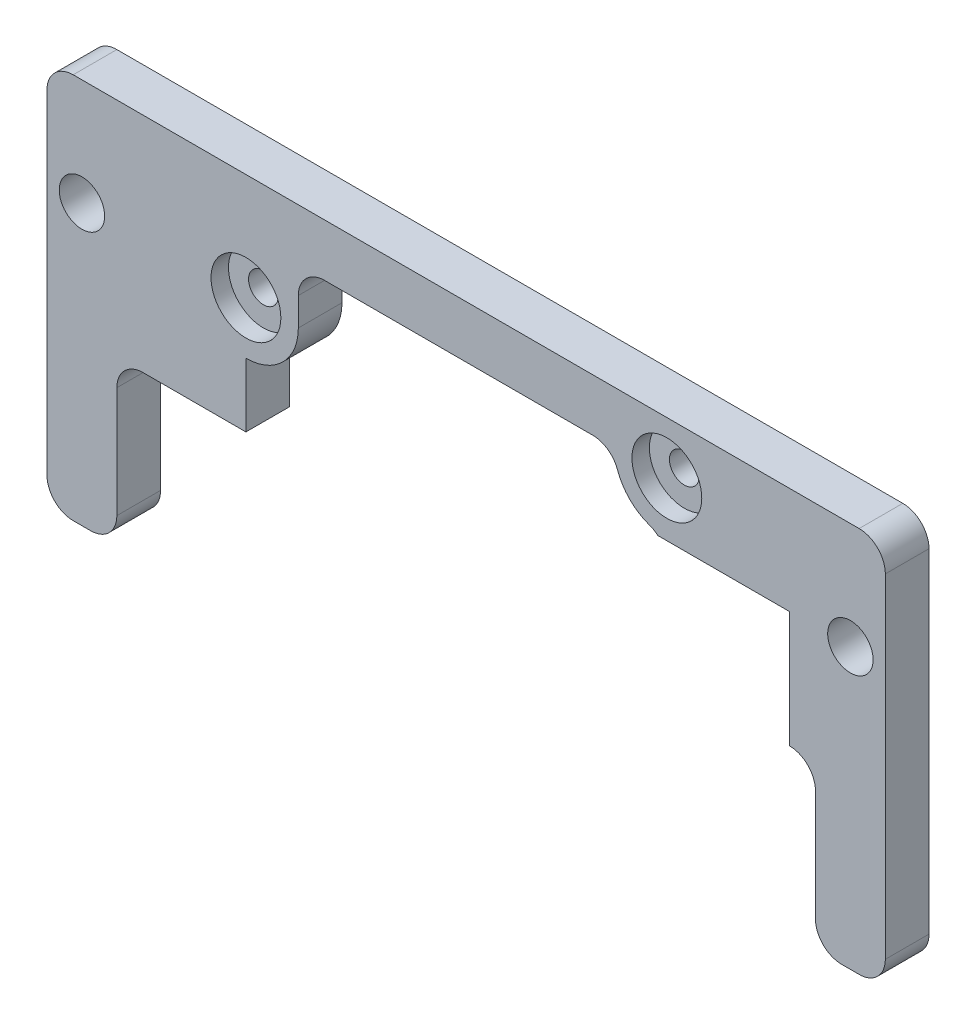
ISO-10303-21;
HEADER;
FILE_DESCRIPTION(('STEP AP214'),'2;1');
FILE_NAME('part.step','',(''),(''),'','','');
FILE_SCHEMA(('AUTOMOTIVE_DESIGN { 1 0 10303 214 1 1 1 1 }'));
ENDSEC;
DATA;
#1=APPLICATION_CONTEXT('core data for automotive mechanical design processes');
#2=APPLICATION_PROTOCOL_DEFINITION('international standard','automotive_design',2000,#1);
#3=PRODUCT_CONTEXT('',#1,'mechanical');
#4=PRODUCT('Part','Part','',(#3));
#5=PRODUCT_RELATED_PRODUCT_CATEGORY('part','',(#4));
#6=PRODUCT_DEFINITION_FORMATION('','',#4);
#7=PRODUCT_DEFINITION_CONTEXT('part definition',#1,'design');
#8=PRODUCT_DEFINITION('design','',#6,#7);
#9=PRODUCT_DEFINITION_SHAPE('','',#8);
#10=(LENGTH_UNIT() NAMED_UNIT(*) SI_UNIT(.MILLI.,.METRE.));
#11=(NAMED_UNIT(*) PLANE_ANGLE_UNIT() SI_UNIT($,.RADIAN.));
#12=(NAMED_UNIT(*) SI_UNIT($,.STERADIAN.) SOLID_ANGLE_UNIT());
#13=UNCERTAINTY_MEASURE_WITH_UNIT(LENGTH_MEASURE(1.E-05),#10,'distance_accuracy_value','');
#14=(GEOMETRIC_REPRESENTATION_CONTEXT(3) GLOBAL_UNCERTAINTY_ASSIGNED_CONTEXT((#13)) GLOBAL_UNIT_ASSIGNED_CONTEXT((#10,
#11,#12)) REPRESENTATION_CONTEXT('',''));
#15=CARTESIAN_POINT('',(0.,0.,0.));
#16=DIRECTION('',(0.,0.,1.));
#17=DIRECTION('',(1.,0.,0.));
#18=AXIS2_PLACEMENT_3D('',#15,#16,#17);
#19=CARTESIAN_POINT('',(66.9795452652619,6.22,5.));
#20=DIRECTION('',(0.,0.,-1.));
#21=DIRECTION('',(-1.,0.,0.));
#22=AXIS2_PLACEMENT_3D('',#19,#20,#21);
#23=CYLINDRICAL_SURFACE('',#22,1.7);
#24=CARTESIAN_POINT('',(66.9795452652619,6.22,0.));
#25=DIRECTION('',(0.,0.,1.));
#26=DIRECTION('',(1.,0.,0.));
#27=AXIS2_PLACEMENT_3D('',#24,#25,#26);
#28=CIRCLE('',#27,1.7);
#29=CARTESIAN_POINT('',(68.6795452652619,6.22,0.));
#30=VERTEX_POINT('',#29);
#31=EDGE_CURVE('E252',#30,#30,#28,.T.);
#32=ORIENTED_EDGE('',*,*,#31,.F.);
#33=EDGE_LOOP('',(#32));
#34=FACE_BOUND('',#33,.T.);
#35=CARTESIAN_POINT('',(66.9795452652619,6.22,3.));
#36=DIRECTION('',(0.,0.,1.));
#37=DIRECTION('',(1.,0.,0.));
#38=AXIS2_PLACEMENT_3D('',#35,#36,#37);
#39=CIRCLE('',#38,1.7);
#40=CARTESIAN_POINT('',(68.6795452652619,6.22,3.));
#41=VERTEX_POINT('',#40);
#42=EDGE_CURVE('E37',#41,#41,#39,.T.);
#43=ORIENTED_EDGE('',*,*,#42,.T.);
#44=EDGE_LOOP('',(#43));
#45=FACE_BOUND('',#44,.T.);
#46=ADVANCED_FACE('F33',(#34,#45),#23,.F.);
#47=CARTESIAN_POINT('',(18.7795452652619,0.,5.));
#48=DIRECTION('',(0.,0.,-1.));
#49=DIRECTION('',(-1.,0.,0.));
#50=AXIS2_PLACEMENT_3D('',#47,#48,#49);
#51=CYLINDRICAL_SURFACE('',#50,1.7);
#52=CARTESIAN_POINT('',(18.7795452652619,0.,0.));
#53=DIRECTION('',(0.,0.,1.));
#54=DIRECTION('',(1.,0.,0.));
#55=AXIS2_PLACEMENT_3D('',#52,#53,#54);
#56=CIRCLE('',#55,1.7);
#57=CARTESIAN_POINT('',(20.4795452652619,0.,0.));
#58=VERTEX_POINT('',#57);
#59=EDGE_CURVE('E257',#58,#58,#56,.T.);
#60=ORIENTED_EDGE('',*,*,#59,.F.);
#61=EDGE_LOOP('',(#60));
#62=FACE_BOUND('',#61,.T.);
#63=CARTESIAN_POINT('',(18.7795452652619,0.,3.));
#64=DIRECTION('',(0.,0.,1.));
#65=DIRECTION('',(1.,0.,0.));
#66=AXIS2_PLACEMENT_3D('',#63,#64,#65);
#67=CIRCLE('',#66,1.7);
#68=CARTESIAN_POINT('',(20.4795452652619,0.,3.));
#69=VERTEX_POINT('',#68);
#70=EDGE_CURVE('E250',#69,#69,#67,.T.);
#71=ORIENTED_EDGE('',*,*,#70,.T.);
#72=EDGE_LOOP('',(#71));
#73=FACE_BOUND('',#72,.T.);
#74=ADVANCED_FACE('F338',(#62,#73),#51,.F.);
#75=CARTESIAN_POINT('',(-1.,9.22,5.));
#76=DIRECTION('',(0.,0.,1.));
#77=DIRECTION('',(1.,0.,0.));
#78=AXIS2_PLACEMENT_3D('',#75,#76,#77);
#79=PLANE('',#78);
#80=DIRECTION('',(0.,-1.,0.));
#81=VECTOR('',#80,1.);
#82=CARTESIAN_POINT('',(18.7795452652619,-10.3122345298576,5.));
#83=LINE('',#82,#81);
#84=CARTESIAN_POINT('',(18.7795452652619,-6.,5.));
#85=VERTEX_POINT('',#84);
#86=CARTESIAN_POINT('',(18.7795452652619,-13.3122345298576,5.));
#87=VERTEX_POINT('',#86);
#88=EDGE_CURVE('E659',#85,#87,#83,.T.);
#89=ORIENTED_EDGE('',*,*,#88,.F.);
#90=CARTESIAN_POINT('',(18.7795452652619,0.,5.));
#91=DIRECTION('',(0.,0.,-1.));
#92=DIRECTION('',(1.,0.,0.));
#93=AXIS2_PLACEMENT_3D('',#90,#91,#92);
#94=CIRCLE('',#93,6.);
#95=CARTESIAN_POINT('',(24.7795452652619,0.,5.));
#96=VERTEX_POINT('',#95);
#97=EDGE_CURVE('E656',#96,#85,#94,.T.);
#98=ORIENTED_EDGE('',*,*,#97,.F.);
#99=DIRECTION('',(0.,-1.,0.));
#100=VECTOR('',#99,1.);
#101=CARTESIAN_POINT('',(24.7795452652619,3.21999999999998,5.));
#102=LINE('',#101,#100);
#103=CARTESIAN_POINT('',(24.7795452652619,3.21999999999998,5.));
#104=VERTEX_POINT('',#103);
#105=EDGE_CURVE('E653',#104,#96,#102,.T.);
#106=ORIENTED_EDGE('',*,*,#105,.F.);
#107=CARTESIAN_POINT('',(27.7795452652619,3.22,5.));
#108=DIRECTION('',(0.,0.,1.));
#109=DIRECTION('',(1.,0.,0.));
#110=AXIS2_PLACEMENT_3D('',#107,#108,#109);
#111=CIRCLE('',#110,3.);
#112=CARTESIAN_POINT('',(27.779545265262,6.22,5.));
#113=VERTEX_POINT('',#112);
#114=EDGE_CURVE('E650',#113,#104,#111,.T.);
#115=ORIENTED_EDGE('',*,*,#114,.F.);
#116=DIRECTION('',(-1.,0.,0.));
#117=VECTOR('',#116,1.);
#118=CARTESIAN_POINT('',(58.4942638910234,6.22,5.));
#119=LINE('',#118,#117);
#120=CARTESIAN_POINT('',(58.4942638910234,6.22,5.));
#121=VERTEX_POINT('',#120);
#122=EDGE_CURVE('E647',#121,#113,#119,.T.);
#123=ORIENTED_EDGE('',*,*,#122,.F.);
#124=CARTESIAN_POINT('',(58.4942638910234,3.22,5.));
#125=DIRECTION('',(0.,0.,1.));
#126=DIRECTION('',(1.,0.,0.));
#127=AXIS2_PLACEMENT_3D('',#124,#125,#126);
#128=CIRCLE('',#127,3.);
#129=CARTESIAN_POINT('',(61.3226910157695,4.22,5.));
#130=VERTEX_POINT('',#129);
#131=EDGE_CURVE('E644',#130,#121,#128,.T.);
#132=ORIENTED_EDGE('',*,*,#131,.F.);
#133=CARTESIAN_POINT('',(66.9795452652619,6.22,5.));
#134=DIRECTION('',(0.,0.,-1.));
#135=DIRECTION('',(-1.,0.,0.));
#136=AXIS2_PLACEMENT_3D('',#133,#134,#135);
#137=CIRCLE('',#136,6.);
#138=CARTESIAN_POINT('',(64.9795452652619,0.56314575050762,5.));
#139=VERTEX_POINT('',#138);
#140=EDGE_CURVE('E638',#139,#130,#137,.T.);
#141=ORIENTED_EDGE('',*,*,#140,.F.);
#142=CARTESIAN_POINT('',(63.9795452652619,-2.26528137423857,5.));
#143=DIRECTION('',(0.,0.,1.));
#144=DIRECTION('',(-1.,0.,0.));
#145=AXIS2_PLACEMENT_3D('',#142,#143,#144);
#146=CIRCLE('',#145,3.);
#147=CARTESIAN_POINT('',(65.9463956143042,0.,5.));
#148=VERTEX_POINT('',#147);
#149=EDGE_CURVE('E635',#148,#139,#146,.T.);
#150=ORIENTED_EDGE('',*,*,#149,.F.);
#151=DIRECTION('',(-1.,0.,0.));
#152=VECTOR('',#151,1.);
#153=CARTESIAN_POINT('',(81.,0.,5.));
#154=LINE('',#153,#152);
#155=CARTESIAN_POINT('',(81.,0.,5.));
#156=VERTEX_POINT('',#155);
#157=EDGE_CURVE('E629',#156,#148,#154,.T.);
#158=ORIENTED_EDGE('',*,*,#157,.F.);
#159=DIRECTION('',(0.,1.,0.));
#160=VECTOR('',#159,1.);
#161=CARTESIAN_POINT('',(81.,-13.3122345298576,5.));
#162=LINE('',#161,#160);
#163=CARTESIAN_POINT('',(81.,-13.3122345298576,5.));
#164=VERTEX_POINT('',#163);
#165=EDGE_CURVE('E619',#164,#156,#162,.T.);
#166=ORIENTED_EDGE('',*,*,#165,.F.);
#167=CARTESIAN_POINT('',(81.,-16.3122345298576,5.));
#168=DIRECTION('',(0.,0.,-1.));
#169=DIRECTION('',(1.,0.,0.));
#170=AXIS2_PLACEMENT_3D('',#167,#168,#169);
#171=CIRCLE('',#170,3.);
#172=CARTESIAN_POINT('',(84.,-16.3122345298576,5.));
#173=VERTEX_POINT('',#172);
#174=EDGE_CURVE('E298',#164,#173,#171,.T.);
#175=ORIENTED_EDGE('',*,*,#174,.T.);
#176=DIRECTION('',(0.,-1.,0.));
#177=VECTOR('',#176,1.);
#178=CARTESIAN_POINT('',(84.,-29.,5.));
#179=LINE('',#178,#177);
#180=CARTESIAN_POINT('',(84.,-29.,5.));
#181=VERTEX_POINT('',#180);
#182=EDGE_CURVE('E300',#173,#181,#179,.T.);
#183=ORIENTED_EDGE('',*,*,#182,.T.);
#184=CARTESIAN_POINT('',(87.,-29.,5.));
#185=DIRECTION('',(0.,0.,1.));
#186=DIRECTION('',(-1.,0.,0.));
#187=AXIS2_PLACEMENT_3D('',#184,#185,#186);
#188=CIRCLE('',#187,3.);
#189=CARTESIAN_POINT('',(87.,-32.,5.));
#190=VERTEX_POINT('',#189);
#191=EDGE_CURVE('E302',#181,#190,#188,.T.);
#192=ORIENTED_EDGE('',*,*,#191,.T.);
#193=DIRECTION('',(1.,0.,0.));
#194=VECTOR('',#193,1.);
#195=CARTESIAN_POINT('',(89.,-32.,5.));
#196=LINE('',#195,#194);
#197=CARTESIAN_POINT('',(89.,-32.,5.));
#198=VERTEX_POINT('',#197);
#199=EDGE_CURVE('E304',#190,#198,#196,.T.);
#200=ORIENTED_EDGE('',*,*,#199,.T.);
#201=CARTESIAN_POINT('',(89.,-29.,5.));
#202=DIRECTION('',(0.,0.,1.));
#203=DIRECTION('',(-1.,0.,0.));
#204=AXIS2_PLACEMENT_3D('',#201,#202,#203);
#205=CIRCLE('',#204,3.00000000000001);
#206=CARTESIAN_POINT('',(92.,-29.,5.));
#207=VERTEX_POINT('',#206);
#208=EDGE_CURVE('E165',#198,#207,#205,.T.);
#209=ORIENTED_EDGE('',*,*,#208,.T.);
#210=DIRECTION('',(0.,1.,0.));
#211=VECTOR('',#210,1.);
#212=CARTESIAN_POINT('',(92.,9.22,5.));
#213=LINE('',#212,#211);
#214=CARTESIAN_POINT('',(92.,9.22,5.));
#215=VERTEX_POINT('',#214);
#216=EDGE_CURVE('E157',#207,#215,#213,.T.);
#217=ORIENTED_EDGE('',*,*,#216,.T.);
#218=CARTESIAN_POINT('',(89.,9.22,5.));
#219=DIRECTION('',(0.,0.,1.));
#220=DIRECTION('',(-1.,0.,0.));
#221=AXIS2_PLACEMENT_3D('',#218,#219,#220);
#222=CIRCLE('',#221,3.);
#223=CARTESIAN_POINT('',(89.,12.22,5.));
#224=VERTEX_POINT('',#223);
#225=EDGE_CURVE('E163',#215,#224,#222,.T.);
#226=ORIENTED_EDGE('',*,*,#225,.T.);
#227=DIRECTION('',(-1.,0.,0.));
#228=VECTOR('',#227,1.);
#229=CARTESIAN_POINT('',(-0.99999999999998,12.22,5.));
#230=LINE('',#229,#228);
#231=CARTESIAN_POINT('',(-0.99999999999998,12.22,5.));
#232=VERTEX_POINT('',#231);
#233=EDGE_CURVE('E52',#224,#232,#230,.T.);
#234=ORIENTED_EDGE('',*,*,#233,.T.);
#235=CARTESIAN_POINT('',(-1.,9.22,5.));
#236=DIRECTION('',(0.,0.,1.));
#237=DIRECTION('',(1.,0.,0.));
#238=AXIS2_PLACEMENT_3D('',#235,#236,#237);
#239=CIRCLE('',#238,3.);
#240=CARTESIAN_POINT('',(-4.,9.21999999999998,5.));
#241=VERTEX_POINT('',#240);
#242=EDGE_CURVE('E215',#232,#241,#239,.T.);
#243=ORIENTED_EDGE('',*,*,#242,.T.);
#244=DIRECTION('',(0.,-1.,0.));
#245=VECTOR('',#244,1.);
#246=CARTESIAN_POINT('',(-4.,9.21999999999998,5.));
#247=LINE('',#246,#245);
#248=CARTESIAN_POINT('',(-4.,-29.,5.));
#249=VERTEX_POINT('',#248);
#250=EDGE_CURVE('E120',#241,#249,#247,.T.);
#251=ORIENTED_EDGE('',*,*,#250,.T.);
#252=CARTESIAN_POINT('',(-0.999999999999996,-29.,5.));
#253=DIRECTION('',(0.,0.,1.));
#254=DIRECTION('',(1.,0.,0.));
#255=AXIS2_PLACEMENT_3D('',#252,#253,#254);
#256=CIRCLE('',#255,3.);
#257=CARTESIAN_POINT('',(-0.999999999999974,-32.,5.));
#258=VERTEX_POINT('',#257);
#259=EDGE_CURVE('E285',#249,#258,#256,.T.);
#260=ORIENTED_EDGE('',*,*,#259,.T.);
#261=DIRECTION('',(1.,0.,0.));
#262=VECTOR('',#261,1.);
#263=CARTESIAN_POINT('',(-0.999999999999974,-32.,5.));
#264=LINE('',#263,#262);
#265=CARTESIAN_POINT('',(0.999999999999982,-32.,5.));
#266=VERTEX_POINT('',#265);
#267=EDGE_CURVE('E287',#258,#266,#264,.T.);
#268=ORIENTED_EDGE('',*,*,#267,.T.);
#269=CARTESIAN_POINT('',(1.,-29.,5.));
#270=DIRECTION('',(0.,0.,1.));
#271=DIRECTION('',(1.,0.,0.));
#272=AXIS2_PLACEMENT_3D('',#269,#270,#271);
#273=CIRCLE('',#272,3.);
#274=CARTESIAN_POINT('',(4.,-29.,5.));
#275=VERTEX_POINT('',#274);
#276=EDGE_CURVE('E289',#266,#275,#273,.T.);
#277=ORIENTED_EDGE('',*,*,#276,.T.);
#278=DIRECTION('',(0.,1.,0.));
#279=VECTOR('',#278,1.);
#280=CARTESIAN_POINT('',(4.,-29.,5.));
#281=LINE('',#280,#279);
#282=CARTESIAN_POINT('',(4.,-16.3122345298576,5.));
#283=VERTEX_POINT('',#282);
#284=EDGE_CURVE('E291',#275,#283,#281,.T.);
#285=ORIENTED_EDGE('',*,*,#284,.T.);
#286=CARTESIAN_POINT('',(7.,-16.3122345298576,5.));
#287=DIRECTION('',(0.,0.,-1.));
#288=DIRECTION('',(-1.,0.,0.));
#289=AXIS2_PLACEMENT_3D('',#286,#287,#288);
#290=CIRCLE('',#289,3.);
#291=CARTESIAN_POINT('',(7.00000000000002,-13.3122345298576,5.));
#292=VERTEX_POINT('',#291);
#293=EDGE_CURVE('E293',#283,#292,#290,.T.);
#294=ORIENTED_EDGE('',*,*,#293,.T.);
#295=DIRECTION('',(1.,0.,0.));
#296=VECTOR('',#295,1.);
#297=CARTESIAN_POINT('',(7.00000000000002,-13.3122345298576,5.));
#298=LINE('',#297,#296);
#299=EDGE_CURVE('E295',#292,#87,#298,.T.);
#300=ORIENTED_EDGE('',*,*,#299,.T.);
#301=EDGE_LOOP('',(#89,#98,#106,#115,#123,#132,#141,#150,#158,#166,#175,#183,#192,#200,#209,
#217,#226,#234,#243,#251,#260,#268,#277,#285,#294,#300));
#302=FACE_BOUND('',#301,.T.);
#303=CARTESIAN_POINT('',(66.9795452652619,6.22,5.));
#304=DIRECTION('',(0.,0.,1.));
#305=DIRECTION('',(1.,0.,0.));
#306=AXIS2_PLACEMENT_3D('',#303,#304,#305);
#307=CIRCLE('',#306,4.00000000000001);
#308=CARTESIAN_POINT('',(70.9795452652619,6.22,5.));
#309=VERTEX_POINT('',#308);
#310=EDGE_CURVE('E267',#309,#309,#307,.T.);
#311=ORIENTED_EDGE('',*,*,#310,.F.);
#312=EDGE_LOOP('',(#311));
#313=FACE_BOUND('',#312,.T.);
#314=CARTESIAN_POINT('',(18.7795452652619,0.,5.));
#315=DIRECTION('',(0.,0.,1.));
#316=DIRECTION('',(1.,0.,0.));
#317=AXIS2_PLACEMENT_3D('',#314,#315,#316);
#318=CIRCLE('',#317,4.);
#319=CARTESIAN_POINT('',(22.7795452652619,0.,5.));
#320=VERTEX_POINT('',#319);
#321=EDGE_CURVE('E260',#320,#320,#318,.T.);
#322=ORIENTED_EDGE('',*,*,#321,.F.);
#323=EDGE_LOOP('',(#322));
#324=FACE_BOUND('',#323,.T.);
#325=CARTESIAN_POINT('',(0.,0.,5.));
#326=DIRECTION('',(0.,0.,1.));
#327=DIRECTION('',(1.,0.,0.));
#328=AXIS2_PLACEMENT_3D('',#325,#326,#327);
#329=CIRCLE('',#328,2.6);
#330=CARTESIAN_POINT('',(2.6,0.,5.));
#331=VERTEX_POINT('',#330);
#332=EDGE_CURVE('E187',#331,#331,#329,.T.);
#333=ORIENTED_EDGE('',*,*,#332,.F.);
#334=EDGE_LOOP('',(#333));
#335=FACE_BOUND('',#334,.T.);
#336=CARTESIAN_POINT('',(88.,0.,5.));
#337=DIRECTION('',(0.,0.,1.));
#338=DIRECTION('',(1.,0.,0.));
#339=AXIS2_PLACEMENT_3D('',#336,#337,#338);
#340=CIRCLE('',#339,2.6);
#341=CARTESIAN_POINT('',(90.6,0.,5.));
#342=VERTEX_POINT('',#341);
#343=EDGE_CURVE('E273',#342,#342,#340,.T.);
#344=ORIENTED_EDGE('',*,*,#343,.F.);
#345=EDGE_LOOP('',(#344));
#346=FACE_BOUND('',#345,.T.);
#347=ADVANCED_FACE('F160',(#302,#313,#324,#335,#346),#79,.T.);
#348=CARTESIAN_POINT('',(-1.,9.22,0.));
#349=DIRECTION('',(0.,0.,1.));
#350=DIRECTION('',(1.,0.,0.));
#351=AXIS2_PLACEMENT_3D('',#348,#349,#350);
#352=PLANE('',#351);
#353=ORIENTED_EDGE('',*,*,#59,.T.);
#354=EDGE_LOOP('',(#353));
#355=FACE_BOUND('',#354,.T.);
#356=CARTESIAN_POINT('',(0.,0.,0.));
#357=DIRECTION('',(0.,0.,1.));
#358=DIRECTION('',(1.,0.,0.));
#359=AXIS2_PLACEMENT_3D('',#356,#357,#358);
#360=CIRCLE('',#359,2.6);
#361=CARTESIAN_POINT('',(2.6,0.,0.));
#362=VERTEX_POINT('',#361);
#363=EDGE_CURVE('E276',#362,#362,#360,.T.);
#364=ORIENTED_EDGE('',*,*,#363,.T.);
#365=EDGE_LOOP('',(#364));
#366=FACE_BOUND('',#365,.T.);
#367=CARTESIAN_POINT('',(18.7795452652619,0.,0.));
#368=DIRECTION('',(0.,0.,-1.));
#369=DIRECTION('',(1.,0.,0.));
#370=AXIS2_PLACEMENT_3D('',#367,#368,#369);
#371=CIRCLE('',#370,6.);
#372=CARTESIAN_POINT('',(24.7795452652619,0.,0.));
#373=VERTEX_POINT('',#372);
#374=CARTESIAN_POINT('',(18.7795452652619,-6.,0.));
#375=VERTEX_POINT('',#374);
#376=EDGE_CURVE('E711',#373,#375,#371,.T.);
#377=ORIENTED_EDGE('',*,*,#376,.T.);
#378=DIRECTION('',(0.,-1.,0.));
#379=VECTOR('',#378,1.);
#380=CARTESIAN_POINT('',(18.7795452652619,-6.,0.));
#381=LINE('',#380,#379);
#382=CARTESIAN_POINT('',(18.7795452652619,-13.3122345298576,0.));
#383=VERTEX_POINT('',#382);
#384=EDGE_CURVE('E690',#375,#383,#381,.T.);
#385=ORIENTED_EDGE('',*,*,#384,.T.);
#386=DIRECTION('',(1.,0.,0.));
#387=VECTOR('',#386,1.);
#388=CARTESIAN_POINT('',(7.00000000000002,-13.3122345298576,0.));
#389=LINE('',#388,#387);
#390=CARTESIAN_POINT('',(7.00000000000002,-13.3122345298576,0.));
#391=VERTEX_POINT('',#390);
#392=EDGE_CURVE('E199',#391,#383,#389,.T.);
#393=ORIENTED_EDGE('',*,*,#392,.F.);
#394=CARTESIAN_POINT('',(7.,-16.3122345298576,0.));
#395=DIRECTION('',(0.,0.,-1.));
#396=DIRECTION('',(-1.,0.,0.));
#397=AXIS2_PLACEMENT_3D('',#394,#395,#396);
#398=CIRCLE('',#397,3.);
#399=CARTESIAN_POINT('',(4.,-16.3122345298576,0.));
#400=VERTEX_POINT('',#399);
#401=EDGE_CURVE('E197',#400,#391,#398,.T.);
#402=ORIENTED_EDGE('',*,*,#401,.F.);
#403=DIRECTION('',(0.,1.,0.));
#404=VECTOR('',#403,1.);
#405=CARTESIAN_POINT('',(4.,-29.,0.));
#406=LINE('',#405,#404);
#407=CARTESIAN_POINT('',(4.,-29.,0.));
#408=VERTEX_POINT('',#407);
#409=EDGE_CURVE('E195',#408,#400,#406,.T.);
#410=ORIENTED_EDGE('',*,*,#409,.F.);
#411=CARTESIAN_POINT('',(1.,-29.,0.));
#412=DIRECTION('',(0.,0.,1.));
#413=DIRECTION('',(1.,0.,0.));
#414=AXIS2_PLACEMENT_3D('',#411,#412,#413);
#415=CIRCLE('',#414,3.);
#416=CARTESIAN_POINT('',(0.999999999999982,-32.,0.));
#417=VERTEX_POINT('',#416);
#418=EDGE_CURVE('E193',#417,#408,#415,.T.);
#419=ORIENTED_EDGE('',*,*,#418,.F.);
#420=DIRECTION('',(1.,0.,0.));
#421=VECTOR('',#420,1.);
#422=CARTESIAN_POINT('',(-0.999999999999974,-32.,0.));
#423=LINE('',#422,#421);
#424=CARTESIAN_POINT('',(-0.999999999999974,-32.,0.));
#425=VERTEX_POINT('',#424);
#426=EDGE_CURVE('E191',#425,#417,#423,.T.);
#427=ORIENTED_EDGE('',*,*,#426,.F.);
#428=CARTESIAN_POINT('',(-0.999999999999996,-29.,0.));
#429=DIRECTION('',(0.,0.,1.));
#430=DIRECTION('',(1.,0.,0.));
#431=AXIS2_PLACEMENT_3D('',#428,#429,#430);
#432=CIRCLE('',#431,3.);
#433=CARTESIAN_POINT('',(-4.,-29.,0.));
#434=VERTEX_POINT('',#433);
#435=EDGE_CURVE('E189',#434,#425,#432,.T.);
#436=ORIENTED_EDGE('',*,*,#435,.F.);
#437=DIRECTION('',(0.,-1.,0.));
#438=VECTOR('',#437,1.);
#439=CARTESIAN_POINT('',(-4.,9.21999999999998,0.));
#440=LINE('',#439,#438);
#441=CARTESIAN_POINT('',(-4.,9.21999999999998,0.));
#442=VERTEX_POINT('',#441);
#443=EDGE_CURVE('E186',#442,#434,#440,.T.);
#444=ORIENTED_EDGE('',*,*,#443,.F.);
#445=CARTESIAN_POINT('',(-1.,9.22,0.));
#446=DIRECTION('',(0.,0.,1.));
#447=DIRECTION('',(1.,0.,0.));
#448=AXIS2_PLACEMENT_3D('',#445,#446,#447);
#449=CIRCLE('',#448,3.);
#450=CARTESIAN_POINT('',(-0.99999999999998,12.22,0.));
#451=VERTEX_POINT('',#450);
#452=EDGE_CURVE('E183',#451,#442,#449,.T.);
#453=ORIENTED_EDGE('',*,*,#452,.F.);
#454=DIRECTION('',(-1.,0.,0.));
#455=VECTOR('',#454,1.);
#456=CARTESIAN_POINT('',(-0.99999999999998,12.22,0.));
#457=LINE('',#456,#455);
#458=CARTESIAN_POINT('',(89.,12.22,0.));
#459=VERTEX_POINT('',#458);
#460=EDGE_CURVE('E112',#459,#451,#457,.T.);
#461=ORIENTED_EDGE('',*,*,#460,.F.);
#462=CARTESIAN_POINT('',(89.,9.22,0.));
#463=DIRECTION('',(0.,0.,1.));
#464=DIRECTION('',(-1.,0.,0.));
#465=AXIS2_PLACEMENT_3D('',#462,#463,#464);
#466=CIRCLE('',#465,3.);
#467=CARTESIAN_POINT('',(92.,9.22,0.));
#468=VERTEX_POINT('',#467);
#469=EDGE_CURVE('E106',#468,#459,#466,.T.);
#470=ORIENTED_EDGE('',*,*,#469,.F.);
#471=DIRECTION('',(0.,1.,0.));
#472=VECTOR('',#471,1.);
#473=CARTESIAN_POINT('',(92.,9.22,0.));
#474=LINE('',#473,#472);
#475=CARTESIAN_POINT('',(92.,-29.,0.));
#476=VERTEX_POINT('',#475);
#477=EDGE_CURVE('E173',#476,#468,#474,.T.);
#478=ORIENTED_EDGE('',*,*,#477,.F.);
#479=CARTESIAN_POINT('',(89.,-29.,0.));
#480=DIRECTION('',(0.,0.,1.));
#481=DIRECTION('',(-1.,0.,0.));
#482=AXIS2_PLACEMENT_3D('',#479,#480,#481);
#483=CIRCLE('',#482,3.00000000000001);
#484=CARTESIAN_POINT('',(89.,-32.,0.));
#485=VERTEX_POINT('',#484);
#486=EDGE_CURVE('E210',#485,#476,#483,.T.);
#487=ORIENTED_EDGE('',*,*,#486,.F.);
#488=DIRECTION('',(1.,0.,0.));
#489=VECTOR('',#488,1.);
#490=CARTESIAN_POINT('',(89.,-32.,0.));
#491=LINE('',#490,#489);
#492=CARTESIAN_POINT('',(87.,-32.,0.));
#493=VERTEX_POINT('',#492);
#494=EDGE_CURVE('E208',#493,#485,#491,.T.);
#495=ORIENTED_EDGE('',*,*,#494,.F.);
#496=CARTESIAN_POINT('',(87.,-29.,0.));
#497=DIRECTION('',(0.,0.,1.));
#498=DIRECTION('',(-1.,0.,0.));
#499=AXIS2_PLACEMENT_3D('',#496,#497,#498);
#500=CIRCLE('',#499,3.);
#501=CARTESIAN_POINT('',(84.,-29.,0.));
#502=VERTEX_POINT('',#501);
#503=EDGE_CURVE('E206',#502,#493,#500,.T.);
#504=ORIENTED_EDGE('',*,*,#503,.F.);
#505=DIRECTION('',(0.,-1.,0.));
#506=VECTOR('',#505,1.);
#507=CARTESIAN_POINT('',(84.,-29.,0.));
#508=LINE('',#507,#506);
#509=CARTESIAN_POINT('',(84.,-16.3122345298576,0.));
#510=VERTEX_POINT('',#509);
#511=EDGE_CURVE('E204',#510,#502,#508,.T.);
#512=ORIENTED_EDGE('',*,*,#511,.F.);
#513=CARTESIAN_POINT('',(81.,-16.3122345298576,0.));
#514=DIRECTION('',(0.,0.,-1.));
#515=DIRECTION('',(1.,0.,0.));
#516=AXIS2_PLACEMENT_3D('',#513,#514,#515);
#517=CIRCLE('',#516,3.);
#518=CARTESIAN_POINT('',(81.,-13.3122345298576,0.));
#519=VERTEX_POINT('',#518);
#520=EDGE_CURVE('E202',#519,#510,#517,.T.);
#521=ORIENTED_EDGE('',*,*,#520,.F.);
#522=DIRECTION('',(0.,1.,0.));
#523=VECTOR('',#522,1.);
#524=CARTESIAN_POINT('',(81.,-13.3122345298576,0.));
#525=LINE('',#524,#523);
#526=CARTESIAN_POINT('',(81.,0.,0.));
#527=VERTEX_POINT('',#526);
#528=EDGE_CURVE('E662',#519,#527,#525,.T.);
#529=ORIENTED_EDGE('',*,*,#528,.T.);
#530=DIRECTION('',(-1.,0.,0.));
#531=VECTOR('',#530,1.);
#532=CARTESIAN_POINT('',(81.,0.,0.));
#533=LINE('',#532,#531);
#534=CARTESIAN_POINT('',(65.9463956143042,0.,0.));
#535=VERTEX_POINT('',#534);
#536=EDGE_CURVE('E734',#527,#535,#533,.T.);
#537=ORIENTED_EDGE('',*,*,#536,.T.);
#538=CARTESIAN_POINT('',(63.9795452652619,-2.26528137423857,0.));
#539=DIRECTION('',(0.,0.,1.));
#540=DIRECTION('',(-1.,0.,0.));
#541=AXIS2_PLACEMENT_3D('',#538,#539,#540);
#542=CIRCLE('',#541,3.);
#543=CARTESIAN_POINT('',(64.9795452652619,0.56314575050762,0.));
#544=VERTEX_POINT('',#543);
#545=EDGE_CURVE('E731',#535,#544,#542,.T.);
#546=ORIENTED_EDGE('',*,*,#545,.T.);
#547=CARTESIAN_POINT('',(66.9795452652619,6.22,0.));
#548=DIRECTION('',(0.,0.,-1.));
#549=DIRECTION('',(-1.,0.,0.));
#550=AXIS2_PLACEMENT_3D('',#547,#548,#549);
#551=CIRCLE('',#550,6.);
#552=CARTESIAN_POINT('',(61.3226910157695,4.22,0.));
#553=VERTEX_POINT('',#552);
#554=EDGE_CURVE('E728',#544,#553,#551,.T.);
#555=ORIENTED_EDGE('',*,*,#554,.T.);
#556=CARTESIAN_POINT('',(58.4942638910234,3.22,0.));
#557=DIRECTION('',(0.,0.,1.));
#558=DIRECTION('',(1.,0.,0.));
#559=AXIS2_PLACEMENT_3D('',#556,#557,#558);
#560=CIRCLE('',#559,3.);
#561=CARTESIAN_POINT('',(58.4942638910234,6.22,0.));
#562=VERTEX_POINT('',#561);
#563=EDGE_CURVE('E725',#553,#562,#560,.T.);
#564=ORIENTED_EDGE('',*,*,#563,.T.);
#565=DIRECTION('',(-1.,0.,0.));
#566=VECTOR('',#565,1.);
#567=CARTESIAN_POINT('',(58.4942638910234,6.22,0.));
#568=LINE('',#567,#566);
#569=CARTESIAN_POINT('',(27.779545265262,6.22,0.));
#570=VERTEX_POINT('',#569);
#571=EDGE_CURVE('E722',#562,#570,#568,.T.);
#572=ORIENTED_EDGE('',*,*,#571,.T.);
#573=CARTESIAN_POINT('',(27.7795452652619,3.22,0.));
#574=DIRECTION('',(0.,0.,1.));
#575=DIRECTION('',(1.,0.,0.));
#576=AXIS2_PLACEMENT_3D('',#573,#574,#575);
#577=CIRCLE('',#576,3.);
#578=CARTESIAN_POINT('',(24.7795452652619,3.21999999999998,0.));
#579=VERTEX_POINT('',#578);
#580=EDGE_CURVE('E719',#570,#579,#577,.T.);
#581=ORIENTED_EDGE('',*,*,#580,.T.);
#582=DIRECTION('',(0.,-1.,0.));
#583=VECTOR('',#582,1.);
#584=CARTESIAN_POINT('',(24.7795452652619,3.21999999999998,0.));
#585=LINE('',#584,#583);
#586=EDGE_CURVE('E714',#579,#373,#585,.T.);
#587=ORIENTED_EDGE('',*,*,#586,.T.);
#588=EDGE_LOOP('',(#377,#385,#393,#402,#410,#419,#427,#436,#444,#453,#461,#470,#478,#487,#495,
#504,#512,#521,#529,#537,#546,#555,#564,#572,#581,#587));
#589=FACE_BOUND('',#588,.T.);
#590=CARTESIAN_POINT('',(88.,0.,0.));
#591=DIRECTION('',(0.,0.,1.));
#592=DIRECTION('',(1.,0.,0.));
#593=AXIS2_PLACEMENT_3D('',#590,#591,#592);
#594=CIRCLE('',#593,2.6);
#595=CARTESIAN_POINT('',(90.6,0.,0.));
#596=VERTEX_POINT('',#595);
#597=EDGE_CURVE('E272',#596,#596,#594,.T.);
#598=ORIENTED_EDGE('',*,*,#597,.T.);
#599=EDGE_LOOP('',(#598));
#600=FACE_BOUND('',#599,.T.);
#601=ORIENTED_EDGE('',*,*,#31,.T.);
#602=EDGE_LOOP('',(#601));
#603=FACE_BOUND('',#602,.T.);
#604=ADVANCED_FACE('F317',(#355,#366,#589,#600,#603),#352,.F.);
#605=CARTESIAN_POINT('',(-1.,9.22,5.));
#606=DIRECTION('',(0.,0.,-1.));
#607=DIRECTION('',(-1.,0.,0.));
#608=AXIS2_PLACEMENT_3D('',#605,#606,#607);
#609=CYLINDRICAL_SURFACE('',#608,3.);
#610=ORIENTED_EDGE('',*,*,#452,.T.);
#611=DIRECTION('',(0.,0.,-1.));
#612=VECTOR('',#611,1.);
#613=CARTESIAN_POINT('',(-4.,9.21999999999998,5.));
#614=LINE('',#613,#612);
#615=EDGE_CURVE('E11',#241,#442,#614,.T.);
#616=ORIENTED_EDGE('',*,*,#615,.F.);
#617=ORIENTED_EDGE('',*,*,#242,.F.);
#618=DIRECTION('',(0.,0.,-1.));
#619=VECTOR('',#618,1.);
#620=CARTESIAN_POINT('',(-0.99999999999998,12.22,5.));
#621=LINE('',#620,#619);
#622=EDGE_CURVE('E179',#232,#451,#621,.T.);
#623=ORIENTED_EDGE('',*,*,#622,.T.);
#624=EDGE_LOOP('',(#610,#616,#617,#623));
#625=FACE_BOUND('',#624,.T.);
#626=ADVANCED_FACE('F35',(#625),#609,.T.);
#627=CARTESIAN_POINT('',(-4.,9.21999999999998,5.));
#628=DIRECTION('',(1.,0.,0.));
#629=DIRECTION('',(0.,1.,0.));
#630=AXIS2_PLACEMENT_3D('',#627,#628,#629);
#631=PLANE('',#630);
#632=ORIENTED_EDGE('',*,*,#443,.T.);
#633=DIRECTION('',(0.,0.,-1.));
#634=VECTOR('',#633,1.);
#635=CARTESIAN_POINT('',(-4.,-29.,5.));
#636=LINE('',#635,#634);
#637=EDGE_CURVE('E43',#249,#434,#636,.T.);
#638=ORIENTED_EDGE('',*,*,#637,.F.);
#639=ORIENTED_EDGE('',*,*,#250,.F.);
#640=ORIENTED_EDGE('',*,*,#615,.T.);
#641=EDGE_LOOP('',(#632,#638,#639,#640));
#642=FACE_BOUND('',#641,.T.);
#643=ADVANCED_FACE('F361',(#642),#631,.F.);
#644=CARTESIAN_POINT('',(-0.999999999999996,-29.,5.));
#645=DIRECTION('',(0.,0.,-1.));
#646=DIRECTION('',(-1.,0.,0.));
#647=AXIS2_PLACEMENT_3D('',#644,#645,#646);
#648=CYLINDRICAL_SURFACE('',#647,3.);
#649=ORIENTED_EDGE('',*,*,#435,.T.);
#650=DIRECTION('',(0.,0.,-1.));
#651=VECTOR('',#650,1.);
#652=CARTESIAN_POINT('',(-0.999999999999974,-32.,5.));
#653=LINE('',#652,#651);
#654=EDGE_CURVE('E246',#258,#425,#653,.T.);
#655=ORIENTED_EDGE('',*,*,#654,.F.);
#656=ORIENTED_EDGE('',*,*,#259,.F.);
#657=ORIENTED_EDGE('',*,*,#637,.T.);
#658=EDGE_LOOP('',(#649,#655,#656,#657));
#659=FACE_BOUND('',#658,.T.);
#660=ADVANCED_FACE('F369',(#659),#648,.T.);
#661=CARTESIAN_POINT('',(-0.999999999999974,-32.,5.));
#662=DIRECTION('',(0.,1.,0.));
#663=DIRECTION('',(0.,0.,1.));
#664=AXIS2_PLACEMENT_3D('',#661,#662,#663);
#665=PLANE('',#664);
#666=ORIENTED_EDGE('',*,*,#426,.T.);
#667=DIRECTION('',(0.,0.,-1.));
#668=VECTOR('',#667,1.);
#669=CARTESIAN_POINT('',(0.999999999999982,-32.,5.));
#670=LINE('',#669,#668);
#671=EDGE_CURVE('E243',#266,#417,#670,.T.);
#672=ORIENTED_EDGE('',*,*,#671,.F.);
#673=ORIENTED_EDGE('',*,*,#267,.F.);
#674=ORIENTED_EDGE('',*,*,#654,.T.);
#675=EDGE_LOOP('',(#666,#672,#673,#674));
#676=FACE_BOUND('',#675,.T.);
#677=ADVANCED_FACE('F373',(#676),#665,.F.);
#678=CARTESIAN_POINT('',(1.,-29.,5.));
#679=DIRECTION('',(0.,0.,-1.));
#680=DIRECTION('',(-1.,0.,0.));
#681=AXIS2_PLACEMENT_3D('',#678,#679,#680);
#682=CYLINDRICAL_SURFACE('',#681,3.);
#683=ORIENTED_EDGE('',*,*,#418,.T.);
#684=DIRECTION('',(0.,0.,-1.));
#685=VECTOR('',#684,1.);
#686=CARTESIAN_POINT('',(4.,-29.,5.));
#687=LINE('',#686,#685);
#688=EDGE_CURVE('E240',#275,#408,#687,.T.);
#689=ORIENTED_EDGE('',*,*,#688,.F.);
#690=ORIENTED_EDGE('',*,*,#276,.F.);
#691=ORIENTED_EDGE('',*,*,#671,.T.);
#692=EDGE_LOOP('',(#683,#689,#690,#691));
#693=FACE_BOUND('',#692,.T.);
#694=ADVANCED_FACE('F379',(#693),#682,.T.);
#695=CARTESIAN_POINT('',(4.,-29.,5.));
#696=DIRECTION('',(-1.,0.,0.));
#697=DIRECTION('',(0.,0.,1.));
#698=AXIS2_PLACEMENT_3D('',#695,#696,#697);
#699=PLANE('',#698);
#700=ORIENTED_EDGE('',*,*,#409,.T.);
#701=DIRECTION('',(0.,0.,-1.));
#702=VECTOR('',#701,1.);
#703=CARTESIAN_POINT('',(4.,-16.3122345298576,5.));
#704=LINE('',#703,#702);
#705=EDGE_CURVE('E237',#283,#400,#704,.T.);
#706=ORIENTED_EDGE('',*,*,#705,.F.);
#707=ORIENTED_EDGE('',*,*,#284,.F.);
#708=ORIENTED_EDGE('',*,*,#688,.T.);
#709=EDGE_LOOP('',(#700,#706,#707,#708));
#710=FACE_BOUND('',#709,.T.);
#711=ADVANCED_FACE('F383',(#710),#699,.F.);
#712=CARTESIAN_POINT('',(7.,-16.3122345298576,5.));
#713=DIRECTION('',(0.,0.,-1.));
#714=DIRECTION('',(-1.,0.,0.));
#715=AXIS2_PLACEMENT_3D('',#712,#713,#714);
#716=CYLINDRICAL_SURFACE('',#715,3.);
#717=ORIENTED_EDGE('',*,*,#401,.T.);
#718=DIRECTION('',(0.,0.,-1.));
#719=VECTOR('',#718,1.);
#720=CARTESIAN_POINT('',(7.00000000000002,-13.3122345298576,5.));
#721=LINE('',#720,#719);
#722=EDGE_CURVE('E234',#292,#391,#721,.T.);
#723=ORIENTED_EDGE('',*,*,#722,.F.);
#724=ORIENTED_EDGE('',*,*,#293,.F.);
#725=ORIENTED_EDGE('',*,*,#705,.T.);
#726=EDGE_LOOP('',(#717,#723,#724,#725));
#727=FACE_BOUND('',#726,.T.);
#728=ADVANCED_FACE('F387',(#727),#716,.F.);
#729=CARTESIAN_POINT('',(7.00000000000002,-13.3122345298576,5.));
#730=DIRECTION('',(0.,1.,0.));
#731=DIRECTION('',(-1.,0.,0.));
#732=AXIS2_PLACEMENT_3D('',#729,#730,#731);
#733=PLANE('',#732);
#734=ORIENTED_EDGE('',*,*,#392,.T.);
#735=DIRECTION('',(0.,0.,1.));
#736=VECTOR('',#735,1.);
#737=CARTESIAN_POINT('',(18.7795452652619,-13.3122345298576,0.));
#738=LINE('',#737,#736);
#739=EDGE_CURVE('E663',#383,#87,#738,.T.);
#740=ORIENTED_EDGE('',*,*,#739,.T.);
#741=ORIENTED_EDGE('',*,*,#299,.F.);
#742=ORIENTED_EDGE('',*,*,#722,.T.);
#743=EDGE_LOOP('',(#734,#740,#741,#742));
#744=FACE_BOUND('',#743,.T.);
#745=ADVANCED_FACE('F391',(#744),#733,.F.);
#746=CARTESIAN_POINT('',(81.,-16.3122345298576,5.));
#747=DIRECTION('',(0.,0.,-1.));
#748=DIRECTION('',(-1.,0.,0.));
#749=AXIS2_PLACEMENT_3D('',#746,#747,#748);
#750=CYLINDRICAL_SURFACE('',#749,3.);
#751=ORIENTED_EDGE('',*,*,#520,.T.);
#752=DIRECTION('',(0.,0.,-1.));
#753=VECTOR('',#752,1.);
#754=CARTESIAN_POINT('',(84.,-16.3122345298576,5.));
#755=LINE('',#754,#753);
#756=EDGE_CURVE('E228',#173,#510,#755,.T.);
#757=ORIENTED_EDGE('',*,*,#756,.F.);
#758=ORIENTED_EDGE('',*,*,#174,.F.);
#759=DIRECTION('',(0.,0.,-1.));
#760=VECTOR('',#759,1.);
#761=CARTESIAN_POINT('',(81.,-13.3122345298576,5.));
#762=LINE('',#761,#760);
#763=EDGE_CURVE('E231',#164,#519,#762,.T.);
#764=ORIENTED_EDGE('',*,*,#763,.T.);
#765=EDGE_LOOP('',(#751,#757,#758,#764));
#766=FACE_BOUND('',#765,.T.);
#767=ADVANCED_FACE('F395',(#766),#750,.F.);
#768=CARTESIAN_POINT('',(84.,-29.,5.));
#769=DIRECTION('',(1.,0.,0.));
#770=DIRECTION('',(0.,0.,-1.));
#771=AXIS2_PLACEMENT_3D('',#768,#769,#770);
#772=PLANE('',#771);
#773=ORIENTED_EDGE('',*,*,#511,.T.);
#774=DIRECTION('',(0.,0.,-1.));
#775=VECTOR('',#774,1.);
#776=CARTESIAN_POINT('',(84.,-29.,5.));
#777=LINE('',#776,#775);
#778=EDGE_CURVE('E225',#181,#502,#777,.T.);
#779=ORIENTED_EDGE('',*,*,#778,.F.);
#780=ORIENTED_EDGE('',*,*,#182,.F.);
#781=ORIENTED_EDGE('',*,*,#756,.T.);
#782=EDGE_LOOP('',(#773,#779,#780,#781));
#783=FACE_BOUND('',#782,.T.);
#784=ADVANCED_FACE('F399',(#783),#772,.F.);
#785=CARTESIAN_POINT('',(87.,-29.,5.));
#786=DIRECTION('',(0.,0.,-1.));
#787=DIRECTION('',(-1.,0.,0.));
#788=AXIS2_PLACEMENT_3D('',#785,#786,#787);
#789=CYLINDRICAL_SURFACE('',#788,3.);
#790=ORIENTED_EDGE('',*,*,#503,.T.);
#791=DIRECTION('',(0.,0.,-1.));
#792=VECTOR('',#791,1.);
#793=CARTESIAN_POINT('',(87.,-32.,5.));
#794=LINE('',#793,#792);
#795=EDGE_CURVE('E222',#190,#493,#794,.T.);
#796=ORIENTED_EDGE('',*,*,#795,.F.);
#797=ORIENTED_EDGE('',*,*,#191,.F.);
#798=ORIENTED_EDGE('',*,*,#778,.T.);
#799=EDGE_LOOP('',(#790,#796,#797,#798));
#800=FACE_BOUND('',#799,.T.);
#801=ADVANCED_FACE('F403',(#800),#789,.T.);
#802=CARTESIAN_POINT('',(89.,-32.,5.));
#803=DIRECTION('',(0.,1.,0.));
#804=DIRECTION('',(0.,0.,1.));
#805=AXIS2_PLACEMENT_3D('',#802,#803,#804);
#806=PLANE('',#805);
#807=ORIENTED_EDGE('',*,*,#494,.T.);
#808=DIRECTION('',(0.,0.,-1.));
#809=VECTOR('',#808,1.);
#810=CARTESIAN_POINT('',(89.,-32.,5.));
#811=LINE('',#810,#809);
#812=EDGE_CURVE('E219',#198,#485,#811,.T.);
#813=ORIENTED_EDGE('',*,*,#812,.F.);
#814=ORIENTED_EDGE('',*,*,#199,.F.);
#815=ORIENTED_EDGE('',*,*,#795,.T.);
#816=EDGE_LOOP('',(#807,#813,#814,#815));
#817=FACE_BOUND('',#816,.T.);
#818=ADVANCED_FACE('F310',(#817),#806,.F.);
#819=CARTESIAN_POINT('',(89.,-29.,5.));
#820=DIRECTION('',(0.,0.,-1.));
#821=DIRECTION('',(-1.,0.,0.));
#822=AXIS2_PLACEMENT_3D('',#819,#820,#821);
#823=CYLINDRICAL_SURFACE('',#822,3.00000000000001);
#824=ORIENTED_EDGE('',*,*,#486,.T.);
#825=DIRECTION('',(0.,0.,-1.));
#826=VECTOR('',#825,1.);
#827=CARTESIAN_POINT('',(92.,-29.,5.));
#828=LINE('',#827,#826);
#829=EDGE_CURVE('E174',#207,#476,#828,.T.);
#830=ORIENTED_EDGE('',*,*,#829,.F.);
#831=ORIENTED_EDGE('',*,*,#208,.F.);
#832=ORIENTED_EDGE('',*,*,#812,.T.);
#833=EDGE_LOOP('',(#824,#830,#831,#832));
#834=FACE_BOUND('',#833,.T.);
#835=ADVANCED_FACE('F314',(#834),#823,.T.);
#836=CARTESIAN_POINT('',(92.,9.22,5.));
#837=DIRECTION('',(-1.,0.,0.));
#838=DIRECTION('',(0.,-1.,0.));
#839=AXIS2_PLACEMENT_3D('',#836,#837,#838);
#840=PLANE('',#839);
#841=ORIENTED_EDGE('',*,*,#477,.T.);
#842=DIRECTION('',(0.,0.,-1.));
#843=VECTOR('',#842,1.);
#844=CARTESIAN_POINT('',(92.,9.22,5.));
#845=LINE('',#844,#843);
#846=EDGE_CURVE('E170',#215,#468,#845,.T.);
#847=ORIENTED_EDGE('',*,*,#846,.F.);
#848=ORIENTED_EDGE('',*,*,#216,.F.);
#849=ORIENTED_EDGE('',*,*,#829,.T.);
#850=EDGE_LOOP('',(#841,#847,#848,#849));
#851=FACE_BOUND('',#850,.T.);
#852=ADVANCED_FACE('F171',(#851),#840,.F.);
#853=CARTESIAN_POINT('',(89.,9.22,5.));
#854=DIRECTION('',(0.,0.,-1.));
#855=DIRECTION('',(-1.,0.,0.));
#856=AXIS2_PLACEMENT_3D('',#853,#854,#855);
#857=CYLINDRICAL_SURFACE('',#856,3.);
#858=ORIENTED_EDGE('',*,*,#469,.T.);
#859=DIRECTION('',(0.,0.,-1.));
#860=VECTOR('',#859,1.);
#861=CARTESIAN_POINT('',(89.,12.22,5.));
#862=LINE('',#861,#860);
#863=EDGE_CURVE('E175',#224,#459,#862,.T.);
#864=ORIENTED_EDGE('',*,*,#863,.F.);
#865=ORIENTED_EDGE('',*,*,#225,.F.);
#866=ORIENTED_EDGE('',*,*,#846,.T.);
#867=EDGE_LOOP('',(#858,#864,#865,#866));
#868=FACE_BOUND('',#867,.T.);
#869=ADVANCED_FACE('F177',(#868),#857,.T.);
#870=CARTESIAN_POINT('',(-0.99999999999998,12.22,5.));
#871=DIRECTION('',(0.,-1.,0.));
#872=DIRECTION('',(1.,0.,0.));
#873=AXIS2_PLACEMENT_3D('',#870,#871,#872);
#874=PLANE('',#873);
#875=ORIENTED_EDGE('',*,*,#460,.T.);
#876=ORIENTED_EDGE('',*,*,#622,.F.);
#877=ORIENTED_EDGE('',*,*,#233,.F.);
#878=ORIENTED_EDGE('',*,*,#863,.T.);
#879=EDGE_LOOP('',(#875,#876,#877,#878));
#880=FACE_BOUND('',#879,.T.);
#881=ADVANCED_FACE('F324',(#880),#874,.F.);
#882=CARTESIAN_POINT('',(0.,0.,5.));
#883=DIRECTION('',(0.,0.,-1.));
#884=DIRECTION('',(-1.,0.,0.));
#885=AXIS2_PLACEMENT_3D('',#882,#883,#884);
#886=CYLINDRICAL_SURFACE('',#885,2.6);
#887=ORIENTED_EDGE('',*,*,#332,.T.);
#888=EDGE_LOOP('',(#887));
#889=FACE_BOUND('',#888,.T.);
#890=ORIENTED_EDGE('',*,*,#363,.F.);
#891=EDGE_LOOP('',(#890));
#892=FACE_BOUND('',#891,.T.);
#893=ADVANCED_FACE('F326',(#889,#892),#886,.F.);
#894=CARTESIAN_POINT('',(88.,0.,5.));
#895=DIRECTION('',(0.,0.,-1.));
#896=DIRECTION('',(-1.,0.,0.));
#897=AXIS2_PLACEMENT_3D('',#894,#895,#896);
#898=CYLINDRICAL_SURFACE('',#897,2.6);
#899=ORIENTED_EDGE('',*,*,#343,.T.);
#900=EDGE_LOOP('',(#899));
#901=FACE_BOUND('',#900,.T.);
#902=ORIENTED_EDGE('',*,*,#597,.F.);
#903=EDGE_LOOP('',(#902));
#904=FACE_BOUND('',#903,.T.);
#905=ADVANCED_FACE('F332',(#901,#904),#898,.F.);
#906=CARTESIAN_POINT('',(18.7795452652619,0.,3.));
#907=DIRECTION('',(0.,0.,1.));
#908=DIRECTION('',(1.,0.,0.));
#909=AXIS2_PLACEMENT_3D('',#906,#907,#908);
#910=CYLINDRICAL_SURFACE('',#909,4.);
#911=CARTESIAN_POINT('',(18.7795452652619,0.,3.));
#912=DIRECTION('',(0.,0.,1.));
#913=DIRECTION('',(1.,0.,0.));
#914=AXIS2_PLACEMENT_3D('',#911,#912,#913);
#915=CIRCLE('',#914,4.);
#916=CARTESIAN_POINT('',(22.7795452652619,0.,3.));
#917=VERTEX_POINT('',#916);
#918=EDGE_CURVE('E253',#917,#917,#915,.T.);
#919=ORIENTED_EDGE('',*,*,#918,.F.);
#920=EDGE_LOOP('',(#919));
#921=FACE_BOUND('',#920,.T.);
#922=ORIENTED_EDGE('',*,*,#321,.T.);
#923=EDGE_LOOP('',(#922));
#924=FACE_BOUND('',#923,.T.);
#925=ADVANCED_FACE('F349',(#921,#924),#910,.F.);
#926=CARTESIAN_POINT('',(18.7795452652619,0.,3.));
#927=DIRECTION('',(0.,0.,1.));
#928=DIRECTION('',(1.,0.,0.));
#929=AXIS2_PLACEMENT_3D('',#926,#927,#928);
#930=PLANE('',#929);
#931=ORIENTED_EDGE('',*,*,#70,.F.);
#932=EDGE_LOOP('',(#931));
#933=FACE_BOUND('',#932,.T.);
#934=ORIENTED_EDGE('',*,*,#918,.T.);
#935=EDGE_LOOP('',(#934));
#936=FACE_BOUND('',#935,.T.);
#937=ADVANCED_FACE('F456',(#933,#936),#930,.T.);
#938=CARTESIAN_POINT('',(66.9795452652619,6.22,3.));
#939=DIRECTION('',(0.,0.,1.));
#940=DIRECTION('',(1.,0.,0.));
#941=AXIS2_PLACEMENT_3D('',#938,#939,#940);
#942=CYLINDRICAL_SURFACE('',#941,4.00000000000001);
#943=CARTESIAN_POINT('',(66.9795452652619,6.22,3.));
#944=DIRECTION('',(0.,0.,1.));
#945=DIRECTION('',(1.,0.,0.));
#946=AXIS2_PLACEMENT_3D('',#943,#944,#945);
#947=CIRCLE('',#946,4.00000000000001);
#948=CARTESIAN_POINT('',(70.9795452652619,6.22,3.));
#949=VERTEX_POINT('',#948);
#950=EDGE_CURVE('E691',#949,#949,#947,.T.);
#951=ORIENTED_EDGE('',*,*,#950,.F.);
#952=EDGE_LOOP('',(#951));
#953=FACE_BOUND('',#952,.T.);
#954=ORIENTED_EDGE('',*,*,#310,.T.);
#955=EDGE_LOOP('',(#954));
#956=FACE_BOUND('',#955,.T.);
#957=ADVANCED_FACE('F465',(#953,#956),#942,.F.);
#958=CARTESIAN_POINT('',(66.9795452652619,6.22,3.));
#959=DIRECTION('',(0.,0.,1.));
#960=DIRECTION('',(1.,0.,0.));
#961=AXIS2_PLACEMENT_3D('',#958,#959,#960);
#962=PLANE('',#961);
#963=ORIENTED_EDGE('',*,*,#42,.F.);
#964=EDGE_LOOP('',(#963));
#965=FACE_BOUND('',#964,.T.);
#966=ORIENTED_EDGE('',*,*,#950,.T.);
#967=EDGE_LOOP('',(#966));
#968=FACE_BOUND('',#967,.T.);
#969=ADVANCED_FACE('F474',(#965,#968),#962,.T.);
#970=CARTESIAN_POINT('',(18.7795452652619,-10.3122345298576,0.));
#971=DIRECTION('',(-1.,0.,0.));
#972=DIRECTION('',(0.,0.,1.));
#973=AXIS2_PLACEMENT_3D('',#970,#971,#972);
#974=PLANE('',#973);
#975=ORIENTED_EDGE('',*,*,#88,.T.);
#976=ORIENTED_EDGE('',*,*,#739,.F.);
#977=ORIENTED_EDGE('',*,*,#384,.F.);
#978=DIRECTION('',(0.,0.,1.));
#979=VECTOR('',#978,1.);
#980=CARTESIAN_POINT('',(18.7795452652619,-6.,0.));
#981=LINE('',#980,#979);
#982=EDGE_CURVE('E666',#375,#85,#981,.T.);
#983=ORIENTED_EDGE('',*,*,#982,.T.);
#984=EDGE_LOOP('',(#975,#976,#977,#983));
#985=FACE_BOUND('',#984,.T.);
#986=ADVANCED_FACE('F484',(#985),#974,.F.);
#987=CARTESIAN_POINT('',(18.7795452652619,0.,0.));
#988=DIRECTION('',(0.,0.,1.));
#989=DIRECTION('',(1.,0.,0.));
#990=AXIS2_PLACEMENT_3D('',#987,#988,#989);
#991=CYLINDRICAL_SURFACE('',#990,6.);
#992=ORIENTED_EDGE('',*,*,#97,.T.);
#993=ORIENTED_EDGE('',*,*,#982,.F.);
#994=ORIENTED_EDGE('',*,*,#376,.F.);
#995=DIRECTION('',(0.,0.,1.));
#996=VECTOR('',#995,1.);
#997=CARTESIAN_POINT('',(24.7795452652619,0.,0.));
#998=LINE('',#997,#996);
#999=EDGE_CURVE('E669',#373,#96,#998,.T.);
#1000=ORIENTED_EDGE('',*,*,#999,.T.);
#1001=EDGE_LOOP('',(#992,#993,#994,#1000));
#1002=FACE_BOUND('',#1001,.T.);
#1003=ADVANCED_FACE('F520',(#1002),#991,.T.);
#1004=CARTESIAN_POINT('',(24.7795452652619,3.21999999999998,0.));
#1005=DIRECTION('',(-1.,0.,0.));
#1006=DIRECTION('',(0.,0.,1.));
#1007=AXIS2_PLACEMENT_3D('',#1004,#1005,#1006);
#1008=PLANE('',#1007);
#1009=ORIENTED_EDGE('',*,*,#105,.T.);
#1010=ORIENTED_EDGE('',*,*,#999,.F.);
#1011=ORIENTED_EDGE('',*,*,#586,.F.);
#1012=DIRECTION('',(0.,0.,1.));
#1013=VECTOR('',#1012,1.);
#1014=CARTESIAN_POINT('',(24.7795452652619,3.21999999999998,0.));
#1015=LINE('',#1014,#1013);
#1016=EDGE_CURVE('E672',#579,#104,#1015,.T.);
#1017=ORIENTED_EDGE('',*,*,#1016,.T.);
#1018=EDGE_LOOP('',(#1009,#1010,#1011,#1017));
#1019=FACE_BOUND('',#1018,.T.);
#1020=ADVANCED_FACE('F530',(#1019),#1008,.F.);
#1021=CARTESIAN_POINT('',(27.7795452652619,3.22,0.));
#1022=DIRECTION('',(0.,0.,1.));
#1023=DIRECTION('',(1.,0.,0.));
#1024=AXIS2_PLACEMENT_3D('',#1021,#1022,#1023);
#1025=CYLINDRICAL_SURFACE('',#1024,3.);
#1026=ORIENTED_EDGE('',*,*,#114,.T.);
#1027=ORIENTED_EDGE('',*,*,#1016,.F.);
#1028=ORIENTED_EDGE('',*,*,#580,.F.);
#1029=DIRECTION('',(0.,0.,1.));
#1030=VECTOR('',#1029,1.);
#1031=CARTESIAN_POINT('',(27.779545265262,6.22,0.));
#1032=LINE('',#1031,#1030);
#1033=EDGE_CURVE('E675',#570,#113,#1032,.T.);
#1034=ORIENTED_EDGE('',*,*,#1033,.T.);
#1035=EDGE_LOOP('',(#1026,#1027,#1028,#1034));
#1036=FACE_BOUND('',#1035,.T.);
#1037=ADVANCED_FACE('F540',(#1036),#1025,.F.);
#1038=CARTESIAN_POINT('',(58.4942638910234,6.22,0.));
#1039=DIRECTION('',(0.,1.,0.));
#1040=DIRECTION('',(-1.,0.,0.));
#1041=AXIS2_PLACEMENT_3D('',#1038,#1039,#1040);
#1042=PLANE('',#1041);
#1043=ORIENTED_EDGE('',*,*,#122,.T.);
#1044=ORIENTED_EDGE('',*,*,#1033,.F.);
#1045=ORIENTED_EDGE('',*,*,#571,.F.);
#1046=DIRECTION('',(0.,0.,1.));
#1047=VECTOR('',#1046,1.);
#1048=CARTESIAN_POINT('',(58.4942638910234,6.22,0.));
#1049=LINE('',#1048,#1047);
#1050=EDGE_CURVE('E678',#562,#121,#1049,.T.);
#1051=ORIENTED_EDGE('',*,*,#1050,.T.);
#1052=EDGE_LOOP('',(#1043,#1044,#1045,#1051));
#1053=FACE_BOUND('',#1052,.T.);
#1054=ADVANCED_FACE('F550',(#1053),#1042,.F.);
#1055=CARTESIAN_POINT('',(58.4942638910234,3.22,0.));
#1056=DIRECTION('',(0.,0.,1.));
#1057=DIRECTION('',(1.,0.,0.));
#1058=AXIS2_PLACEMENT_3D('',#1055,#1056,#1057);
#1059=CYLINDRICAL_SURFACE('',#1058,3.);
#1060=ORIENTED_EDGE('',*,*,#131,.T.);
#1061=ORIENTED_EDGE('',*,*,#1050,.F.);
#1062=ORIENTED_EDGE('',*,*,#563,.F.);
#1063=DIRECTION('',(0.,0.,1.));
#1064=VECTOR('',#1063,1.);
#1065=CARTESIAN_POINT('',(61.3226910157695,4.22,0.));
#1066=LINE('',#1065,#1064);
#1067=EDGE_CURVE('E681',#553,#130,#1066,.T.);
#1068=ORIENTED_EDGE('',*,*,#1067,.T.);
#1069=EDGE_LOOP('',(#1060,#1061,#1062,#1068));
#1070=FACE_BOUND('',#1069,.T.);
#1071=ADVANCED_FACE('F560',(#1070),#1059,.F.);
#1072=CARTESIAN_POINT('',(66.9795452652619,6.22,0.));
#1073=DIRECTION('',(0.,0.,1.));
#1074=DIRECTION('',(1.,0.,0.));
#1075=AXIS2_PLACEMENT_3D('',#1072,#1073,#1074);
#1076=CYLINDRICAL_SURFACE('',#1075,6.);
#1077=ORIENTED_EDGE('',*,*,#140,.T.);
#1078=ORIENTED_EDGE('',*,*,#1067,.F.);
#1079=ORIENTED_EDGE('',*,*,#554,.F.);
#1080=DIRECTION('',(0.,0.,1.));
#1081=VECTOR('',#1080,1.);
#1082=CARTESIAN_POINT('',(64.9795452652619,0.56314575050762,0.));
#1083=LINE('',#1082,#1081);
#1084=EDGE_CURVE('E684',#544,#139,#1083,.T.);
#1085=ORIENTED_EDGE('',*,*,#1084,.T.);
#1086=EDGE_LOOP('',(#1077,#1078,#1079,#1085));
#1087=FACE_BOUND('',#1086,.T.);
#1088=ADVANCED_FACE('F570',(#1087),#1076,.T.);
#1089=CARTESIAN_POINT('',(63.9795452652619,-2.26528137423857,0.));
#1090=DIRECTION('',(0.,0.,1.));
#1091=DIRECTION('',(1.,0.,0.));
#1092=AXIS2_PLACEMENT_3D('',#1089,#1090,#1091);
#1093=CYLINDRICAL_SURFACE('',#1092,3.);
#1094=ORIENTED_EDGE('',*,*,#149,.T.);
#1095=ORIENTED_EDGE('',*,*,#1084,.F.);
#1096=ORIENTED_EDGE('',*,*,#545,.F.);
#1097=DIRECTION('',(0.,0.,1.));
#1098=VECTOR('',#1097,1.);
#1099=CARTESIAN_POINT('',(65.9463956143042,0.,0.));
#1100=LINE('',#1099,#1098);
#1101=EDGE_CURVE('E687',#535,#148,#1100,.T.);
#1102=ORIENTED_EDGE('',*,*,#1101,.T.);
#1103=EDGE_LOOP('',(#1094,#1095,#1096,#1102));
#1104=FACE_BOUND('',#1103,.T.);
#1105=ADVANCED_FACE('F580',(#1104),#1093,.F.);
#1106=CARTESIAN_POINT('',(81.,0.,0.));
#1107=DIRECTION('',(0.,1.,0.));
#1108=DIRECTION('',(0.,0.,1.));
#1109=AXIS2_PLACEMENT_3D('',#1106,#1107,#1108);
#1110=PLANE('',#1109);
#1111=ORIENTED_EDGE('',*,*,#157,.T.);
#1112=ORIENTED_EDGE('',*,*,#1101,.F.);
#1113=ORIENTED_EDGE('',*,*,#536,.F.);
#1114=DIRECTION('',(0.,0.,1.));
#1115=VECTOR('',#1114,1.);
#1116=CARTESIAN_POINT('',(81.,0.,0.));
#1117=LINE('',#1116,#1115);
#1118=EDGE_CURVE('E623',#527,#156,#1117,.T.);
#1119=ORIENTED_EDGE('',*,*,#1118,.T.);
#1120=EDGE_LOOP('',(#1111,#1112,#1113,#1119));
#1121=FACE_BOUND('',#1120,.T.);
#1122=ADVANCED_FACE('F590',(#1121),#1110,.F.);
#1123=CARTESIAN_POINT('',(81.,-13.3122345298576,0.));
#1124=DIRECTION('',(1.,0.,0.));
#1125=DIRECTION('',(0.,0.,-1.));
#1126=AXIS2_PLACEMENT_3D('',#1123,#1124,#1125);
#1127=PLANE('',#1126);
#1128=ORIENTED_EDGE('',*,*,#165,.T.);
#1129=ORIENTED_EDGE('',*,*,#1118,.F.);
#1130=ORIENTED_EDGE('',*,*,#528,.F.);
#1131=ORIENTED_EDGE('',*,*,#763,.F.);
#1132=EDGE_LOOP('',(#1128,#1129,#1130,#1131));
#1133=FACE_BOUND('',#1132,.T.);
#1134=ADVANCED_FACE('F600',(#1133),#1127,.F.);
#1135=CLOSED_SHELL('',(#46,#74,#347,#604,#626,#643,#660,#677,#694,#711,#728,#745,#767,#784,#801,
#818,#835,#852,#869,#881,#893,#905,#925,#937,#957,#969,#986,#1003,#1020,#1037,#1054,#1071,#1088,
#1105,#1122,#1134));
#1136=MANIFOLD_SOLID_BREP('B2',#1135);
#1137=ADVANCED_BREP_SHAPE_REPRESENTATION('',(#18,#1136),#14);
#1138=SHAPE_DEFINITION_REPRESENTATION(#9,#1137);
ENDSEC;
END-ISO-10303-21;
